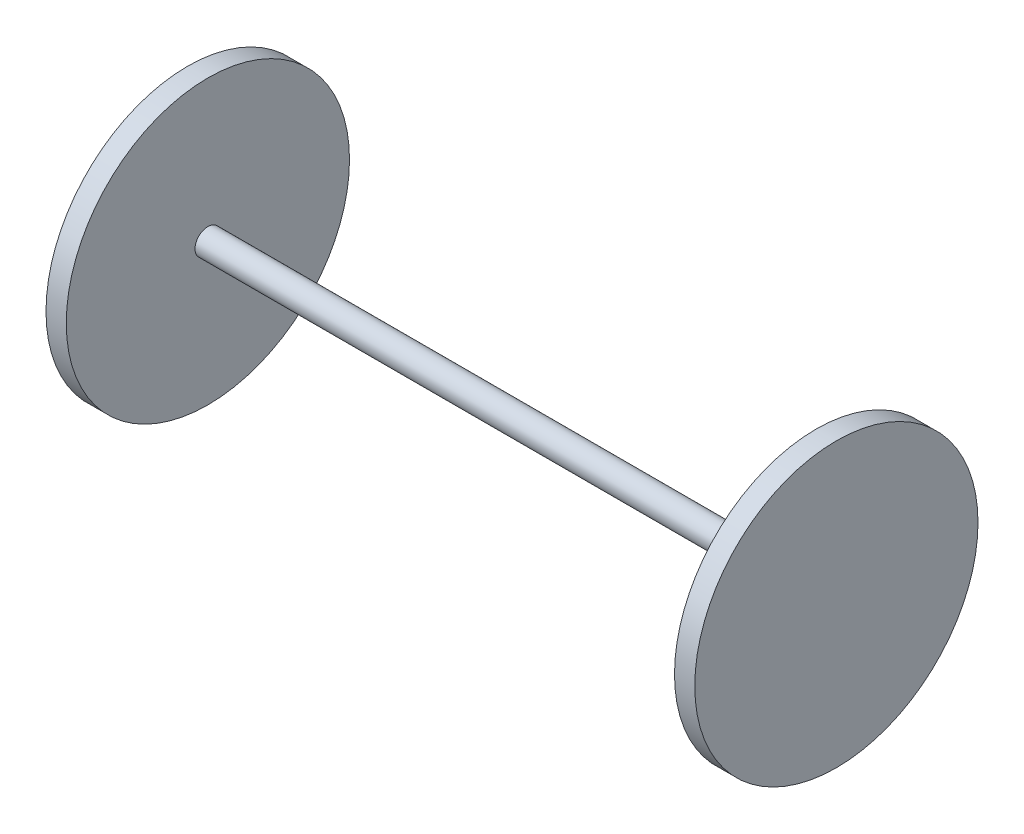
ISO-10303-21;
HEADER;
FILE_DESCRIPTION(('STEP AP214'),'2;1');
FILE_NAME('part.step','',(''),(''),'','','');
FILE_SCHEMA(('AUTOMOTIVE_DESIGN { 1 0 10303 214 1 1 1 1 }'));
ENDSEC;
DATA;
#1=APPLICATION_CONTEXT('core data for automotive mechanical design processes');
#2=APPLICATION_PROTOCOL_DEFINITION('international standard','automotive_design',2000,#1);
#3=PRODUCT_CONTEXT('',#1,'mechanical');
#4=PRODUCT('Part','Part','',(#3));
#5=PRODUCT_RELATED_PRODUCT_CATEGORY('part','',(#4));
#6=PRODUCT_DEFINITION_FORMATION('','',#4);
#7=PRODUCT_DEFINITION_CONTEXT('part definition',#1,'design');
#8=PRODUCT_DEFINITION('design','',#6,#7);
#9=PRODUCT_DEFINITION_SHAPE('','',#8);
#10=(LENGTH_UNIT() NAMED_UNIT(*) SI_UNIT(.MILLI.,.METRE.));
#11=(NAMED_UNIT(*) PLANE_ANGLE_UNIT() SI_UNIT($,.RADIAN.));
#12=(NAMED_UNIT(*) SI_UNIT($,.STERADIAN.) SOLID_ANGLE_UNIT());
#13=UNCERTAINTY_MEASURE_WITH_UNIT(LENGTH_MEASURE(1.E-05),#10,'distance_accuracy_value','');
#14=(GEOMETRIC_REPRESENTATION_CONTEXT(3) GLOBAL_UNCERTAINTY_ASSIGNED_CONTEXT((#13)) GLOBAL_UNIT_ASSIGNED_CONTEXT((#10,
#11,#12)) REPRESENTATION_CONTEXT('',''));
#15=CARTESIAN_POINT('',(0.,0.,0.));
#16=DIRECTION('',(0.,0.,1.));
#17=DIRECTION('',(1.,0.,0.));
#18=AXIS2_PLACEMENT_3D('',#15,#16,#17);
#19=CARTESIAN_POINT('',(75.,0.,0.));
#20=DIRECTION('',(-1.,0.,0.));
#21=DIRECTION('',(0.,0.,1.));
#22=AXIS2_PLACEMENT_3D('',#19,#20,#21);
#23=CYLINDRICAL_SURFACE('',#22,3.175);
#24=CARTESIAN_POINT('',(75.,0.,0.));
#25=DIRECTION('',(1.,0.,0.));
#26=DIRECTION('',(0.,0.,-1.));
#27=AXIS2_PLACEMENT_3D('',#24,#25,#26);
#28=CIRCLE('',#27,3.175);
#29=CARTESIAN_POINT('',(75.,0.,-3.175));
#30=VERTEX_POINT('',#29);
#31=EDGE_CURVE('E10',#30,#30,#28,.T.);
#32=ORIENTED_EDGE('',*,*,#31,.F.);
#33=EDGE_LOOP('',(#32));
#34=FACE_BOUND('',#33,.T.);
#35=CARTESIAN_POINT('',(-75.,0.,0.));
#36=DIRECTION('',(1.,0.,0.));
#37=DIRECTION('',(0.,0.,-1.));
#38=AXIS2_PLACEMENT_3D('',#35,#36,#37);
#39=CIRCLE('',#38,3.175);
#40=CARTESIAN_POINT('',(-75.,0.,-3.175));
#41=VERTEX_POINT('',#40);
#42=EDGE_CURVE('E44',#41,#41,#39,.T.);
#43=ORIENTED_EDGE('',*,*,#42,.T.);
#44=EDGE_LOOP('',(#43));
#45=FACE_BOUND('',#44,.T.);
#46=ADVANCED_FACE('F41',(#34,#45),#23,.T.);
#47=CARTESIAN_POINT('',(80.,0.,0.));
#48=DIRECTION('',(-1.,0.,0.));
#49=DIRECTION('',(0.,0.,1.));
#50=AXIS2_PLACEMENT_3D('',#47,#48,#49);
#51=CYLINDRICAL_SURFACE('',#50,34.925);
#52=CARTESIAN_POINT('',(80.,0.,0.));
#53=DIRECTION('',(1.,0.,0.));
#54=DIRECTION('',(0.,0.,-1.));
#55=AXIS2_PLACEMENT_3D('',#52,#53,#54);
#56=CIRCLE('',#55,34.925);
#57=CARTESIAN_POINT('',(80.,0.,-34.925));
#58=VERTEX_POINT('',#57);
#59=EDGE_CURVE('E49',#58,#58,#56,.T.);
#60=ORIENTED_EDGE('',*,*,#59,.F.);
#61=EDGE_LOOP('',(#60));
#62=FACE_BOUND('',#61,.T.);
#63=CARTESIAN_POINT('',(75.,0.,0.));
#64=DIRECTION('',(1.,0.,0.));
#65=DIRECTION('',(0.,0.,-1.));
#66=AXIS2_PLACEMENT_3D('',#63,#64,#65);
#67=CIRCLE('',#66,34.925);
#68=CARTESIAN_POINT('',(75.,0.,-34.925));
#69=VERTEX_POINT('',#68);
#70=EDGE_CURVE('E54',#69,#69,#67,.T.);
#71=ORIENTED_EDGE('',*,*,#70,.T.);
#72=EDGE_LOOP('',(#71));
#73=FACE_BOUND('',#72,.T.);
#74=ADVANCED_FACE('F95',(#62,#73),#51,.T.);
#75=CARTESIAN_POINT('',(80.,0.,0.));
#76=DIRECTION('',(1.,0.,0.));
#77=DIRECTION('',(0.,0.,-1.));
#78=AXIS2_PLACEMENT_3D('',#75,#76,#77);
#79=PLANE('',#78);
#80=ORIENTED_EDGE('',*,*,#59,.T.);
#81=EDGE_LOOP('',(#80));
#82=FACE_BOUND('',#81,.T.);
#83=ADVANCED_FACE('F91',(#82),#79,.T.);
#84=CARTESIAN_POINT('',(75.,0.,0.));
#85=DIRECTION('',(1.,0.,0.));
#86=DIRECTION('',(0.,0.,-1.));
#87=AXIS2_PLACEMENT_3D('',#84,#85,#86);
#88=PLANE('',#87);
#89=ORIENTED_EDGE('',*,*,#31,.T.);
#90=EDGE_LOOP('',(#89));
#91=FACE_BOUND('',#90,.T.);
#92=ORIENTED_EDGE('',*,*,#70,.F.);
#93=EDGE_LOOP('',(#92));
#94=FACE_BOUND('',#93,.T.);
#95=ADVANCED_FACE('F83',(#91,#94),#88,.F.);
#96=CARTESIAN_POINT('',(-80.,0.,0.));
#97=DIRECTION('',(1.,0.,0.));
#98=DIRECTION('',(0.,0.,-1.));
#99=AXIS2_PLACEMENT_3D('',#96,#97,#98);
#100=CYLINDRICAL_SURFACE('',#99,34.925);
#101=CARTESIAN_POINT('',(-80.,0.,0.));
#102=DIRECTION('',(1.,0.,0.));
#103=DIRECTION('',(0.,0.,-1.));
#104=AXIS2_PLACEMENT_3D('',#101,#102,#103);
#105=CIRCLE('',#104,34.925);
#106=CARTESIAN_POINT('',(-80.,0.,-34.925));
#107=VERTEX_POINT('',#106);
#108=EDGE_CURVE('E64',#107,#107,#105,.T.);
#109=ORIENTED_EDGE('',*,*,#108,.T.);
#110=EDGE_LOOP('',(#109));
#111=FACE_BOUND('',#110,.T.);
#112=CARTESIAN_POINT('',(-75.,0.,0.));
#113=DIRECTION('',(1.,0.,0.));
#114=DIRECTION('',(0.,0.,-1.));
#115=AXIS2_PLACEMENT_3D('',#112,#113,#114);
#116=CIRCLE('',#115,34.925);
#117=CARTESIAN_POINT('',(-75.,0.,-34.925));
#118=VERTEX_POINT('',#117);
#119=EDGE_CURVE('E60',#118,#118,#116,.T.);
#120=ORIENTED_EDGE('',*,*,#119,.F.);
#121=EDGE_LOOP('',(#120));
#122=FACE_BOUND('',#121,.T.);
#123=ADVANCED_FACE('F81',(#111,#122),#100,.T.);
#124=CARTESIAN_POINT('',(-80.,0.,0.));
#125=DIRECTION('',(-1.,0.,0.));
#126=DIRECTION('',(0.,0.,-1.));
#127=AXIS2_PLACEMENT_3D('',#124,#125,#126);
#128=PLANE('',#127);
#129=ORIENTED_EDGE('',*,*,#108,.F.);
#130=EDGE_LOOP('',(#129));
#131=FACE_BOUND('',#130,.T.);
#132=ADVANCED_FACE('F77',(#131),#128,.T.);
#133=CARTESIAN_POINT('',(-75.,0.,0.));
#134=DIRECTION('',(-1.,0.,0.));
#135=DIRECTION('',(0.,0.,-1.));
#136=AXIS2_PLACEMENT_3D('',#133,#134,#135);
#137=PLANE('',#136);
#138=ORIENTED_EDGE('',*,*,#42,.F.);
#139=EDGE_LOOP('',(#138));
#140=FACE_BOUND('',#139,.T.);
#141=ORIENTED_EDGE('',*,*,#119,.T.);
#142=EDGE_LOOP('',(#141));
#143=FACE_BOUND('',#142,.T.);
#144=ADVANCED_FACE('F74',(#140,#143),#137,.F.);
#145=CLOSED_SHELL('',(#46,#74,#83,#95,#123,#132,#144));
#146=MANIFOLD_SOLID_BREP('B2',#145);
#147=ADVANCED_BREP_SHAPE_REPRESENTATION('',(#18,#146),#14);
#148=SHAPE_DEFINITION_REPRESENTATION(#9,#147);
ENDSEC;
END-ISO-10303-21;
